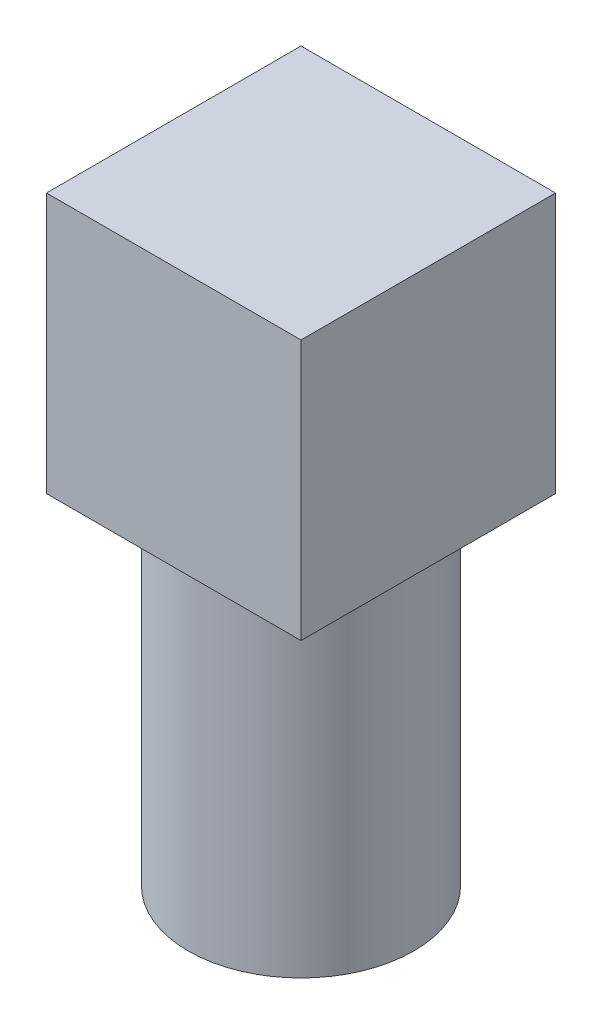
ISO-10303-21;
HEADER;
FILE_DESCRIPTION(('STEP AP214'),'2;1');
FILE_NAME('part.step','',(''),(''),'','','');
FILE_SCHEMA(('AUTOMOTIVE_DESIGN { 1 0 10303 214 1 1 1 1 }'));
ENDSEC;
DATA;
#1=APPLICATION_CONTEXT('core data for automotive mechanical design processes');
#2=APPLICATION_PROTOCOL_DEFINITION('international standard','automotive_design',2000,#1);
#3=PRODUCT_CONTEXT('',#1,'mechanical');
#4=PRODUCT('Part','Part','',(#3));
#5=PRODUCT_RELATED_PRODUCT_CATEGORY('part','',(#4));
#6=PRODUCT_DEFINITION_FORMATION('','',#4);
#7=PRODUCT_DEFINITION_CONTEXT('part definition',#1,'design');
#8=PRODUCT_DEFINITION('design','',#6,#7);
#9=PRODUCT_DEFINITION_SHAPE('','',#8);
#10=(LENGTH_UNIT() NAMED_UNIT(*) SI_UNIT(.MILLI.,.METRE.));
#11=(NAMED_UNIT(*) PLANE_ANGLE_UNIT() SI_UNIT($,.RADIAN.));
#12=(NAMED_UNIT(*) SI_UNIT($,.STERADIAN.) SOLID_ANGLE_UNIT());
#13=UNCERTAINTY_MEASURE_WITH_UNIT(LENGTH_MEASURE(1.E-05),#10,'distance_accuracy_value','');
#14=(GEOMETRIC_REPRESENTATION_CONTEXT(3) GLOBAL_UNCERTAINTY_ASSIGNED_CONTEXT((#13)) GLOBAL_UNIT_ASSIGNED_CONTEXT((#10,
#11,#12)) REPRESENTATION_CONTEXT('',''));
#15=CARTESIAN_POINT('',(0.,0.,0.));
#16=DIRECTION('',(0.,0.,1.));
#17=DIRECTION('',(1.,0.,0.));
#18=AXIS2_PLACEMENT_3D('',#15,#16,#17);
#19=CARTESIAN_POINT('',(22.,45.,22.));
#20=DIRECTION('',(-1.,0.,0.));
#21=DIRECTION('',(0.,0.,1.));
#22=AXIS2_PLACEMENT_3D('',#19,#20,#21);
#23=PLANE('',#22);
#24=DIRECTION('',(0.,0.,-1.));
#25=VECTOR('',#24,1.);
#26=CARTESIAN_POINT('',(22.,0.,22.));
#27=LINE('',#26,#25);
#28=CARTESIAN_POINT('',(22.,0.,22.));
#29=VERTEX_POINT('',#28);
#30=CARTESIAN_POINT('',(22.,0.,-22.));
#31=VERTEX_POINT('',#30);
#32=EDGE_CURVE('E110',#29,#31,#27,.T.);
#33=ORIENTED_EDGE('',*,*,#32,.T.);
#34=DIRECTION('',(0.,-1.,0.));
#35=VECTOR('',#34,1.);
#36=CARTESIAN_POINT('',(22.,45.,-22.));
#37=LINE('',#36,#35);
#38=CARTESIAN_POINT('',(22.,45.,-22.));
#39=VERTEX_POINT('',#38);
#40=EDGE_CURVE('E42',#39,#31,#37,.T.);
#41=ORIENTED_EDGE('',*,*,#40,.F.);
#42=DIRECTION('',(0.,0.,-1.));
#43=VECTOR('',#42,1.);
#44=CARTESIAN_POINT('',(22.,45.,22.));
#45=LINE('',#44,#43);
#46=CARTESIAN_POINT('',(22.,45.,22.));
#47=VERTEX_POINT('',#46);
#48=EDGE_CURVE('E93',#47,#39,#45,.T.);
#49=ORIENTED_EDGE('',*,*,#48,.F.);
#50=DIRECTION('',(0.,-1.,0.));
#51=VECTOR('',#50,1.);
#52=CARTESIAN_POINT('',(22.,45.,22.));
#53=LINE('',#52,#51);
#54=EDGE_CURVE('E106',#47,#29,#53,.T.);
#55=ORIENTED_EDGE('',*,*,#54,.T.);
#56=EDGE_LOOP('',(#33,#41,#49,#55));
#57=FACE_BOUND('',#56,.T.);
#58=ADVANCED_FACE('F39',(#57),#23,.F.);
#59=CARTESIAN_POINT('',(-22.,45.,-22.));
#60=DIRECTION('',(0.,0.,1.));
#61=DIRECTION('',(1.,0.,0.));
#62=AXIS2_PLACEMENT_3D('',#59,#60,#61);
#63=PLANE('',#62);
#64=DIRECTION('',(-1.,0.,0.));
#65=VECTOR('',#64,1.);
#66=CARTESIAN_POINT('',(-22.,0.,-22.));
#67=LINE('',#66,#65);
#68=CARTESIAN_POINT('',(-22.,0.,-22.));
#69=VERTEX_POINT('',#68);
#70=EDGE_CURVE('E99',#31,#69,#67,.T.);
#71=ORIENTED_EDGE('',*,*,#70,.T.);
#72=DIRECTION('',(0.,-1.,0.));
#73=VECTOR('',#72,1.);
#74=CARTESIAN_POINT('',(-22.,45.,-22.));
#75=LINE('',#74,#73);
#76=CARTESIAN_POINT('',(-22.,45.,-22.));
#77=VERTEX_POINT('',#76);
#78=EDGE_CURVE('E97',#77,#69,#75,.T.);
#79=ORIENTED_EDGE('',*,*,#78,.F.);
#80=DIRECTION('',(-1.,0.,0.));
#81=VECTOR('',#80,1.);
#82=CARTESIAN_POINT('',(-22.,45.,-22.));
#83=LINE('',#82,#81);
#84=EDGE_CURVE('E88',#39,#77,#83,.T.);
#85=ORIENTED_EDGE('',*,*,#84,.F.);
#86=ORIENTED_EDGE('',*,*,#40,.T.);
#87=EDGE_LOOP('',(#71,#79,#85,#86));
#88=FACE_BOUND('',#87,.T.);
#89=ADVANCED_FACE('F98',(#88),#63,.F.);
#90=CARTESIAN_POINT('',(-22.,45.,22.));
#91=DIRECTION('',(1.,0.,0.));
#92=DIRECTION('',(0.,0.,-1.));
#93=AXIS2_PLACEMENT_3D('',#90,#91,#92);
#94=PLANE('',#93);
#95=DIRECTION('',(0.,0.,1.));
#96=VECTOR('',#95,1.);
#97=CARTESIAN_POINT('',(-22.,0.,22.));
#98=LINE('',#97,#96);
#99=CARTESIAN_POINT('',(-22.,0.,22.));
#100=VERTEX_POINT('',#99);
#101=EDGE_CURVE('E74',#69,#100,#98,.T.);
#102=ORIENTED_EDGE('',*,*,#101,.T.);
#103=DIRECTION('',(0.,-1.,0.));
#104=VECTOR('',#103,1.);
#105=CARTESIAN_POINT('',(-22.,45.,22.));
#106=LINE('',#105,#104);
#107=CARTESIAN_POINT('',(-22.,45.,22.));
#108=VERTEX_POINT('',#107);
#109=EDGE_CURVE('E101',#108,#100,#106,.T.);
#110=ORIENTED_EDGE('',*,*,#109,.F.);
#111=DIRECTION('',(0.,0.,1.));
#112=VECTOR('',#111,1.);
#113=CARTESIAN_POINT('',(-22.,45.,22.));
#114=LINE('',#113,#112);
#115=EDGE_CURVE('E91',#77,#108,#114,.T.);
#116=ORIENTED_EDGE('',*,*,#115,.F.);
#117=ORIENTED_EDGE('',*,*,#78,.T.);
#118=EDGE_LOOP('',(#102,#110,#116,#117));
#119=FACE_BOUND('',#118,.T.);
#120=ADVANCED_FACE('F102',(#119),#94,.F.);
#121=CARTESIAN_POINT('',(-22.,45.,22.));
#122=DIRECTION('',(0.,0.,-1.));
#123=DIRECTION('',(-1.,0.,0.));
#124=AXIS2_PLACEMENT_3D('',#121,#122,#123);
#125=PLANE('',#124);
#126=DIRECTION('',(1.,0.,0.));
#127=VECTOR('',#126,1.);
#128=CARTESIAN_POINT('',(-22.,0.,22.));
#129=LINE('',#128,#127);
#130=EDGE_CURVE('E80',#100,#29,#129,.T.);
#131=ORIENTED_EDGE('',*,*,#130,.T.);
#132=ORIENTED_EDGE('',*,*,#54,.F.);
#133=DIRECTION('',(1.,0.,0.));
#134=VECTOR('',#133,1.);
#135=CARTESIAN_POINT('',(-22.,45.,22.));
#136=LINE('',#135,#134);
#137=EDGE_CURVE('E57',#108,#47,#136,.T.);
#138=ORIENTED_EDGE('',*,*,#137,.F.);
#139=ORIENTED_EDGE('',*,*,#109,.T.);
#140=EDGE_LOOP('',(#131,#132,#138,#139));
#141=FACE_BOUND('',#140,.T.);
#142=ADVANCED_FACE('F124',(#141),#125,.F.);
#143=CARTESIAN_POINT('',(0.,45.,0.));
#144=DIRECTION('',(0.,-1.,0.));
#145=DIRECTION('',(0.,0.,-1.));
#146=AXIS2_PLACEMENT_3D('',#143,#144,#145);
#147=PLANE('',#146);
#148=ORIENTED_EDGE('',*,*,#48,.T.);
#149=ORIENTED_EDGE('',*,*,#84,.T.);
#150=ORIENTED_EDGE('',*,*,#115,.T.);
#151=ORIENTED_EDGE('',*,*,#137,.T.);
#152=EDGE_LOOP('',(#148,#149,#150,#151));
#153=FACE_BOUND('',#152,.T.);
#154=ADVANCED_FACE('F89',(#153),#147,.F.);
#155=CARTESIAN_POINT('',(0.,0.,0.));
#156=DIRECTION('',(0.,-1.,0.));
#157=DIRECTION('',(0.,0.,-1.));
#158=AXIS2_PLACEMENT_3D('',#155,#156,#157);
#159=PLANE('',#158);
#160=CARTESIAN_POINT('',(0.,0.,0.));
#161=DIRECTION('',(0.,-1.,0.));
#162=DIRECTION('',(0.,0.,-1.));
#163=AXIS2_PLACEMENT_3D('',#160,#161,#162);
#164=CIRCLE('',#163,19.5);
#165=CARTESIAN_POINT('',(0.,0.,-19.5));
#166=VERTEX_POINT('',#165);
#167=EDGE_CURVE('E11',#166,#166,#164,.T.);
#168=ORIENTED_EDGE('',*,*,#167,.F.);
#169=EDGE_LOOP('',(#168));
#170=FACE_BOUND('',#169,.T.);
#171=ORIENTED_EDGE('',*,*,#32,.F.);
#172=ORIENTED_EDGE('',*,*,#130,.F.);
#173=ORIENTED_EDGE('',*,*,#101,.F.);
#174=ORIENTED_EDGE('',*,*,#70,.F.);
#175=EDGE_LOOP('',(#171,#172,#173,#174));
#176=FACE_BOUND('',#175,.T.);
#177=ADVANCED_FACE('F127',(#170,#176),#159,.T.);
#178=CARTESIAN_POINT('',(0.,-58.72,0.));
#179=DIRECTION('',(0.,1.,0.));
#180=DIRECTION('',(0.,0.,1.));
#181=AXIS2_PLACEMENT_3D('',#178,#179,#180);
#182=CYLINDRICAL_SURFACE('',#181,19.5);
#183=CARTESIAN_POINT('',(0.,-58.72,0.));
#184=DIRECTION('',(0.,-1.,0.));
#185=DIRECTION('',(0.,0.,-1.));
#186=AXIS2_PLACEMENT_3D('',#183,#184,#185);
#187=CIRCLE('',#186,19.5);
#188=CARTESIAN_POINT('',(0.,-58.72,-19.5));
#189=VERTEX_POINT('',#188);
#190=EDGE_CURVE('E114',#189,#189,#187,.T.);
#191=ORIENTED_EDGE('',*,*,#190,.F.);
#192=EDGE_LOOP('',(#191));
#193=FACE_BOUND('',#192,.T.);
#194=ORIENTED_EDGE('',*,*,#167,.T.);
#195=EDGE_LOOP('',(#194));
#196=FACE_BOUND('',#195,.T.);
#197=ADVANCED_FACE('F137',(#193,#196),#182,.T.);
#198=CARTESIAN_POINT('',(0.,-58.72,0.));
#199=DIRECTION('',(0.,-1.,0.));
#200=DIRECTION('',(0.,0.,-1.));
#201=AXIS2_PLACEMENT_3D('',#198,#199,#200);
#202=PLANE('',#201);
#203=ORIENTED_EDGE('',*,*,#190,.T.);
#204=EDGE_LOOP('',(#203));
#205=FACE_BOUND('',#204,.T.);
#206=ADVANCED_FACE('F135',(#205),#202,.T.);
#207=CLOSED_SHELL('',(#58,#89,#120,#142,#154,#177,#197,#206));
#208=MANIFOLD_SOLID_BREP('B2',#207);
#209=ADVANCED_BREP_SHAPE_REPRESENTATION('',(#18,#208),#14);
#210=SHAPE_DEFINITION_REPRESENTATION(#9,#209);
ENDSEC;
END-ISO-10303-21;
